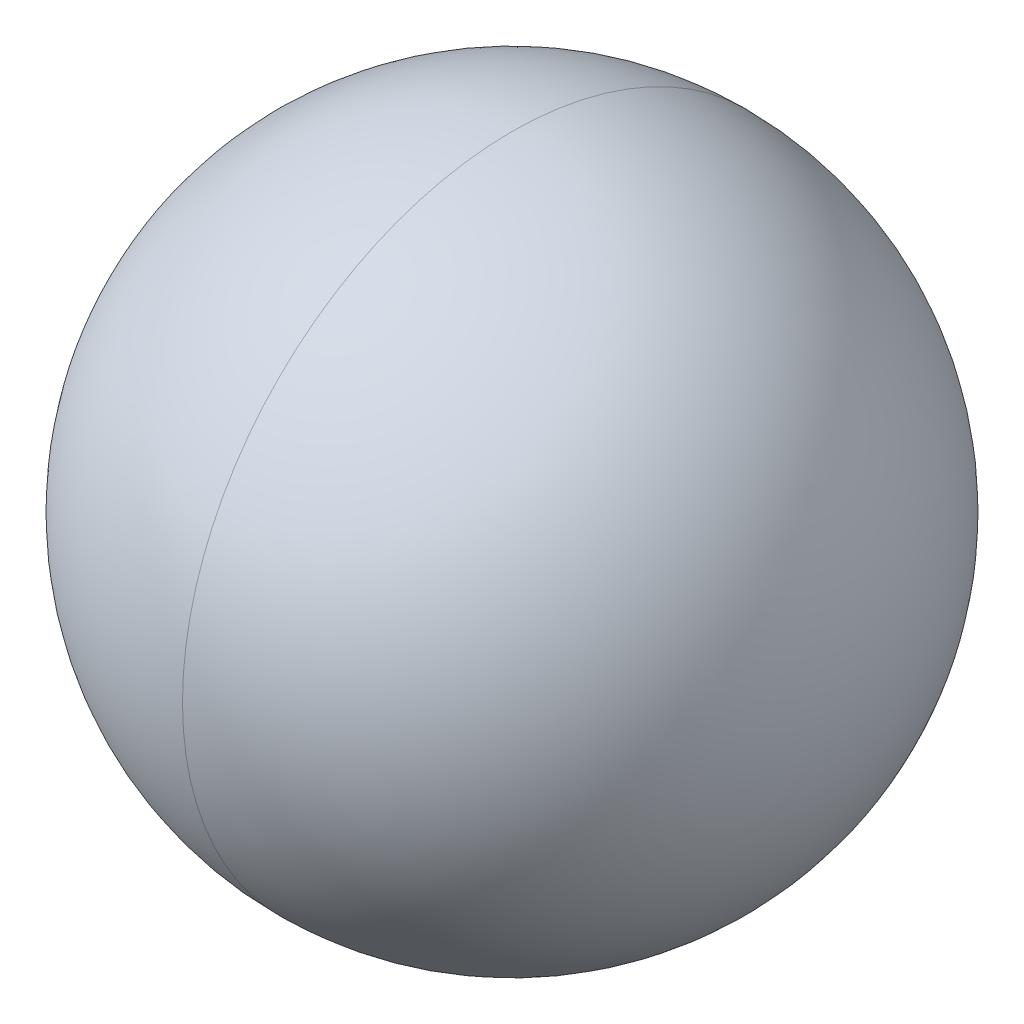
ISO-10303-21;
HEADER;
FILE_DESCRIPTION(('STEP AP214'),'2;1');
FILE_NAME('part.step','',(''),(''),'','','');
FILE_SCHEMA(('AUTOMOTIVE_DESIGN { 1 0 10303 214 1 1 1 1 }'));
ENDSEC;
DATA;
#1=APPLICATION_CONTEXT('core data for automotive mechanical design processes');
#2=APPLICATION_PROTOCOL_DEFINITION('international standard','automotive_design',2000,#1);
#3=PRODUCT_CONTEXT('',#1,'mechanical');
#4=PRODUCT('Part','Part','',(#3));
#5=PRODUCT_RELATED_PRODUCT_CATEGORY('part','',(#4));
#6=PRODUCT_DEFINITION_FORMATION('','',#4);
#7=PRODUCT_DEFINITION_CONTEXT('part definition',#1,'design');
#8=PRODUCT_DEFINITION('design','',#6,#7);
#9=PRODUCT_DEFINITION_SHAPE('','',#8);
#10=(LENGTH_UNIT() NAMED_UNIT(*) SI_UNIT(.MILLI.,.METRE.));
#11=(NAMED_UNIT(*) PLANE_ANGLE_UNIT() SI_UNIT($,.RADIAN.));
#12=(NAMED_UNIT(*) SI_UNIT($,.STERADIAN.) SOLID_ANGLE_UNIT());
#13=UNCERTAINTY_MEASURE_WITH_UNIT(LENGTH_MEASURE(1.E-05),#10,'distance_accuracy_value','');
#14=(GEOMETRIC_REPRESENTATION_CONTEXT(3) GLOBAL_UNCERTAINTY_ASSIGNED_CONTEXT((#13)) GLOBAL_UNIT_ASSIGNED_CONTEXT((#10,
#11,#12)) REPRESENTATION_CONTEXT('',''));
#15=CARTESIAN_POINT('',(0.,0.,0.));
#16=DIRECTION('',(0.,0.,1.));
#17=DIRECTION('',(1.,0.,0.));
#18=AXIS2_PLACEMENT_3D('',#15,#16,#17);
#19=CARTESIAN_POINT('',(0.175,0.175,-0.01));
#20=DIRECTION('',(1.,0.,0.));
#21=DIRECTION('',(0.,1.,0.));
#22=AXIS2_PLACEMENT_3D('',#19,#20,#21);
#23=SPHERICAL_SURFACE('',#22,0.09);
#24=CARTESIAN_POINT('',(0.175,0.175,-0.01));
#25=DIRECTION('',(-1.,0.,0.));
#26=DIRECTION('',(0.,0.,1.));
#27=AXIS2_PLACEMENT_3D('',#24,#25,#26);
#28=CIRCLE('',#27,0.09);
#29=CARTESIAN_POINT('',(0.175,0.265,-0.01));
#30=VERTEX_POINT('',#29);
#31=CARTESIAN_POINT('',(0.175,0.175,-0.1));
#32=VERTEX_POINT('',#31);
#33=EDGE_CURVE('E11',#30,#32,#28,.T.);
#34=ORIENTED_EDGE('',*,*,#33,.F.);
#35=CARTESIAN_POINT('',(0.175,0.265,-0.01));
#36=CARTESIAN_POINT('',(0.203274333882308,0.264999999999999,-0.00999999999999997));
#37=CARTESIAN_POINT('',(0.231575047902662,0.253928649635885,-0.01));
#38=CARTESIAN_POINT('',(0.253928649635883,0.23157504790266,-0.00999999999999997));
#39=CARTESIAN_POINT('',(0.265,0.203274333882309,-0.01));
#40=CARTESIAN_POINT('',(0.265,0.175,-0.01));
#41=B_SPLINE_CURVE_WITH_KNOTS('',5,(#35,#36,#37,#38,#39,#40),.UNSPECIFIED.,.F.,.F.,(6,6),(0.,
1.5707963267949),.UNSPECIFIED.);
#42=CARTESIAN_POINT('',(0.265,0.175,-0.01));
#43=VERTEX_POINT('',#42);
#44=EDGE_CURVE('E24',#30,#43,#41,.T.);
#45=ORIENTED_EDGE('',*,*,#44,.T.);
#46=ORIENTED_EDGE('',*,*,#44,.F.);
#47=CARTESIAN_POINT('',(0.175,0.175,0.08));
#48=VERTEX_POINT('',#47);
#49=EDGE_CURVE('E25',#48,#30,#28,.T.);
#50=ORIENTED_EDGE('',*,*,#49,.F.);
#51=CARTESIAN_POINT('',(0.175,0.175,-0.01));
#52=DIRECTION('',(1.,0.,0.));
#53=DIRECTION('',(0.,1.,0.));
#54=AXIS2_PLACEMENT_3D('',#51,#52,#53);
#55=CIRCLE('',#54,0.09);
#56=EDGE_CURVE('E46',#48,#32,#55,.T.);
#57=ORIENTED_EDGE('',*,*,#56,.T.);
#58=EDGE_LOOP('',(#34,#45,#46,#50,#57));
#59=FACE_BOUND('',#58,.T.);
#60=ADVANCED_FACE('F17',(#59),#23,.T.);
#61=CARTESIAN_POINT('',(0.175,0.175,-0.01));
#62=DIRECTION('',(1.,0.,0.));
#63=DIRECTION('',(0.,1.,0.));
#64=AXIS2_PLACEMENT_3D('',#61,#62,#63);
#65=SPHERICAL_SURFACE('',#64,0.09);
#66=ORIENTED_EDGE('',*,*,#56,.F.);
#67=ORIENTED_EDGE('',*,*,#49,.T.);
#68=CARTESIAN_POINT('',(0.085,0.175,-0.01));
#69=CARTESIAN_POINT('',(0.0849999999999998,0.203274333882308,-0.00999999999999998));
#70=CARTESIAN_POINT('',(0.0960713503641165,0.231575047902661,-0.0100000000000001));
#71=CARTESIAN_POINT('',(0.118424952097339,0.253928649635884,-0.00999999999999999));
#72=CARTESIAN_POINT('',(0.146725666117692,0.265,-0.01));
#73=CARTESIAN_POINT('',(0.175,0.265,-0.01));
#74=B_SPLINE_CURVE_WITH_KNOTS('',5,(#68,#69,#70,#71,#72,#73),.UNSPECIFIED.,.F.,.F.,(6,6),
(-1.5707963267949,0.),.UNSPECIFIED.);
#75=CARTESIAN_POINT('',(0.085,0.175,-0.01));
#76=VERTEX_POINT('',#75);
#77=EDGE_CURVE('E44',#76,#30,#74,.T.);
#78=ORIENTED_EDGE('',*,*,#77,.F.);
#79=ORIENTED_EDGE('',*,*,#77,.T.);
#80=ORIENTED_EDGE('',*,*,#33,.T.);
#81=EDGE_LOOP('',(#66,#67,#78,#79,#80));
#82=FACE_BOUND('',#81,.T.);
#83=ADVANCED_FACE('F45',(#82),#65,.T.);
#84=CLOSED_SHELL('',(#60,#83));
#85=MANIFOLD_SOLID_BREP('B1',#84);
#86=ADVANCED_BREP_SHAPE_REPRESENTATION('',(#18,#85),#14);
#87=SHAPE_DEFINITION_REPRESENTATION(#9,#86);
ENDSEC;
END-ISO-10303-21;
